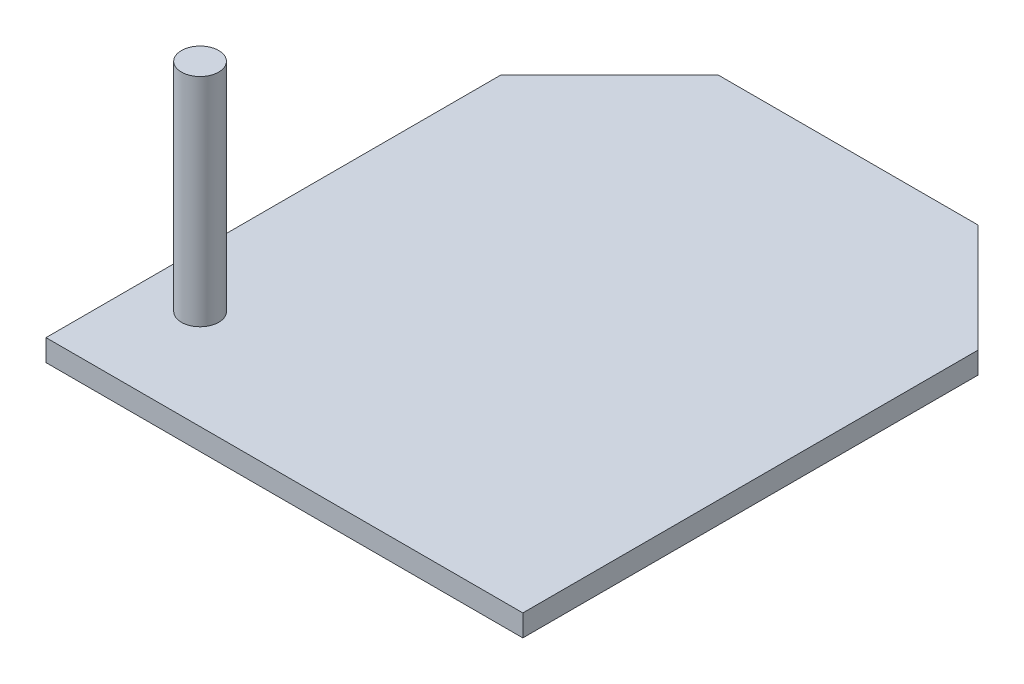
ISO-10303-21;
HEADER;
FILE_DESCRIPTION(('STEP AP214'),'2;1');
FILE_NAME('part.step','',(''),(''),'','','');
FILE_SCHEMA(('AUTOMOTIVE_DESIGN { 1 0 10303 214 1 1 1 1 }'));
ENDSEC;
DATA;
#1=APPLICATION_CONTEXT('core data for automotive mechanical design processes');
#2=APPLICATION_PROTOCOL_DEFINITION('international standard','automotive_design',2000,#1);
#3=PRODUCT_CONTEXT('',#1,'mechanical');
#4=PRODUCT('Part','Part','',(#3));
#5=PRODUCT_RELATED_PRODUCT_CATEGORY('part','',(#4));
#6=PRODUCT_DEFINITION_FORMATION('','',#4);
#7=PRODUCT_DEFINITION_CONTEXT('part definition',#1,'design');
#8=PRODUCT_DEFINITION('design','',#6,#7);
#9=PRODUCT_DEFINITION_SHAPE('','',#8);
#10=(LENGTH_UNIT() NAMED_UNIT(*) SI_UNIT(.MILLI.,.METRE.));
#11=(NAMED_UNIT(*) PLANE_ANGLE_UNIT() SI_UNIT($,.RADIAN.));
#12=(NAMED_UNIT(*) SI_UNIT($,.STERADIAN.) SOLID_ANGLE_UNIT());
#13=UNCERTAINTY_MEASURE_WITH_UNIT(LENGTH_MEASURE(1.E-05),#10,'distance_accuracy_value','');
#14=(GEOMETRIC_REPRESENTATION_CONTEXT(3) GLOBAL_UNCERTAINTY_ASSIGNED_CONTEXT((#13)) GLOBAL_UNIT_ASSIGNED_CONTEXT((#10,
#11,#12)) REPRESENTATION_CONTEXT('',''));
#15=CARTESIAN_POINT('',(0.,0.,0.));
#16=DIRECTION('',(0.,0.,1.));
#17=DIRECTION('',(1.,0.,0.));
#18=AXIS2_PLACEMENT_3D('',#15,#16,#17);
#19=CARTESIAN_POINT('',(-9.48923841059602,1.,-10.9870860927152));
#20=DIRECTION('',(0.,-1.,0.));
#21=DIRECTION('',(0.,0.,-1.));
#22=AXIS2_PLACEMENT_3D('',#19,#20,#21);
#23=PLANE('',#22);
#24=DIRECTION('',(-1.,0.,0.));
#25=VECTOR('',#24,1.);
#26=CARTESIAN_POINT('',(-9.48923841059602,1.,-10.9870860927152));
#27=LINE('',#26,#25);
#28=CARTESIAN_POINT('',(7.51076158940397,1.,-10.9870860927152));
#29=VERTEX_POINT('',#28);
#30=CARTESIAN_POINT('',(-4.489238410596,1.,-10.9870860927152));
#31=VERTEX_POINT('',#30);
#32=EDGE_CURVE('E115',#29,#31,#27,.T.);
#33=ORIENTED_EDGE('',*,*,#32,.T.);
#34=DIRECTION('',(0.707106781186549,0.,-0.707106781186546));
#35=VECTOR('',#34,1.);
#36=CARTESIAN_POINT('',(-9.48923841059602,1.,-5.98708609271523));
#37=LINE('',#36,#35);
#38=CARTESIAN_POINT('',(-9.48923841059602,1.,-5.98708609271523));
#39=VERTEX_POINT('',#38);
#40=EDGE_CURVE('E92',#31,#39,#37,.F.);
#41=ORIENTED_EDGE('',*,*,#40,.T.);
#42=DIRECTION('',(0.,0.,1.));
#43=VECTOR('',#42,1.);
#44=CARTESIAN_POINT('',(-9.48923841059602,1.,15.0129139072848));
#45=LINE('',#44,#43);
#46=CARTESIAN_POINT('',(-9.48923841059602,1.,15.0129139072848));
#47=VERTEX_POINT('',#46);
#48=EDGE_CURVE('E86',#39,#47,#45,.T.);
#49=ORIENTED_EDGE('',*,*,#48,.T.);
#50=DIRECTION('',(1.,0.,0.));
#51=VECTOR('',#50,1.);
#52=CARTESIAN_POINT('',(-9.48923841059602,1.,15.0129139072848));
#53=LINE('',#52,#51);
#54=CARTESIAN_POINT('',(12.510761589404,1.,15.0129139072848));
#55=VERTEX_POINT('',#54);
#56=EDGE_CURVE('E89',#47,#55,#53,.T.);
#57=ORIENTED_EDGE('',*,*,#56,.T.);
#58=DIRECTION('',(0.,0.,-1.));
#59=VECTOR('',#58,1.);
#60=CARTESIAN_POINT('',(12.510761589404,1.,15.0129139072848));
#61=LINE('',#60,#59);
#62=CARTESIAN_POINT('',(12.510761589404,1.,-5.9870860927152));
#63=VERTEX_POINT('',#62);
#64=EDGE_CURVE('E105',#55,#63,#61,.T.);
#65=ORIENTED_EDGE('',*,*,#64,.T.);
#66=DIRECTION('',(0.707106781186546,0.,0.707106781186549));
#67=VECTOR('',#66,1.);
#68=CARTESIAN_POINT('',(7.51076158940397,1.,-10.9870860927152));
#69=LINE('',#68,#67);
#70=EDGE_CURVE('E126',#63,#29,#69,.F.);
#71=ORIENTED_EDGE('',*,*,#70,.T.);
#72=EDGE_LOOP('',(#33,#41,#49,#57,#65,#71));
#73=FACE_BOUND('',#72,.T.);
#74=CARTESIAN_POINT('',(-6.97572857498585,1.,10.4177302678323));
#75=DIRECTION('',(0.,-1.,0.));
#76=DIRECTION('',(0.,0.,-1.));
#77=AXIS2_PLACEMENT_3D('',#74,#75,#76);
#78=CIRCLE('',#77,0.861123247014774);
#79=CARTESIAN_POINT('',(-6.97572857498585,1.,9.55660702081755));
#80=VERTEX_POINT('',#79);
#81=EDGE_CURVE('E11',#80,#80,#78,.F.);
#82=ORIENTED_EDGE('',*,*,#81,.F.);
#83=EDGE_LOOP('',(#82));
#84=FACE_BOUND('',#83,.T.);
#85=ADVANCED_FACE('F31',(#73,#84),#23,.F.);
#86=CARTESIAN_POINT('',(-9.48923841059602,1.,15.0129139072848));
#87=DIRECTION('',(1.,0.,0.));
#88=DIRECTION('',(0.,0.,-1.));
#89=AXIS2_PLACEMENT_3D('',#86,#87,#88);
#90=PLANE('',#89);
#91=ORIENTED_EDGE('',*,*,#48,.F.);
#92=DIRECTION('',(0.,-1.,0.));
#93=VECTOR('',#92,1.);
#94=CARTESIAN_POINT('',(-9.48923841059602,1.,-5.98708609271523));
#95=LINE('',#94,#93);
#96=CARTESIAN_POINT('',(-9.48923841059602,0.,-5.98708609271523));
#97=VERTEX_POINT('',#96);
#98=EDGE_CURVE('E111',#39,#97,#95,.T.);
#99=ORIENTED_EDGE('',*,*,#98,.T.);
#100=DIRECTION('',(0.,0.,1.));
#101=VECTOR('',#100,1.);
#102=CARTESIAN_POINT('',(-9.48923841059602,0.,15.0129139072848));
#103=LINE('',#102,#101);
#104=CARTESIAN_POINT('',(-9.48923841059602,0.,15.0129139072848));
#105=VERTEX_POINT('',#104);
#106=EDGE_CURVE('E109',#97,#105,#103,.T.);
#107=ORIENTED_EDGE('',*,*,#106,.T.);
#108=DIRECTION('',(0.,-1.,0.));
#109=VECTOR('',#108,1.);
#110=CARTESIAN_POINT('',(-9.48923841059602,1.,15.0129139072848));
#111=LINE('',#110,#109);
#112=EDGE_CURVE('E102',#47,#105,#111,.T.);
#113=ORIENTED_EDGE('',*,*,#112,.F.);
#114=EDGE_LOOP('',(#91,#99,#107,#113));
#115=FACE_BOUND('',#114,.T.);
#116=ADVANCED_FACE('F107',(#115),#90,.F.);
#117=CARTESIAN_POINT('',(-9.48923841059602,1.,15.0129139072848));
#118=DIRECTION('',(0.,0.,-1.));
#119=DIRECTION('',(-1.,0.,0.));
#120=AXIS2_PLACEMENT_3D('',#117,#118,#119);
#121=PLANE('',#120);
#122=DIRECTION('',(1.,0.,0.));
#123=VECTOR('',#122,1.);
#124=CARTESIAN_POINT('',(-9.48923841059602,0.,15.0129139072848));
#125=LINE('',#124,#123);
#126=CARTESIAN_POINT('',(12.510761589404,0.,15.0129139072848));
#127=VERTEX_POINT('',#126);
#128=EDGE_CURVE('E139',#105,#127,#125,.T.);
#129=ORIENTED_EDGE('',*,*,#128,.T.);
#130=DIRECTION('',(0.,-1.,0.));
#131=VECTOR('',#130,1.);
#132=CARTESIAN_POINT('',(12.510761589404,1.,15.0129139072848));
#133=LINE('',#132,#131);
#134=EDGE_CURVE('E104',#55,#127,#133,.T.);
#135=ORIENTED_EDGE('',*,*,#134,.F.);
#136=ORIENTED_EDGE('',*,*,#56,.F.);
#137=ORIENTED_EDGE('',*,*,#112,.T.);
#138=EDGE_LOOP('',(#129,#135,#136,#137));
#139=FACE_BOUND('',#138,.T.);
#140=ADVANCED_FACE('F101',(#139),#121,.F.);
#141=CARTESIAN_POINT('',(12.510761589404,1.,15.0129139072848));
#142=DIRECTION('',(-1.,0.,0.));
#143=DIRECTION('',(0.,0.,1.));
#144=AXIS2_PLACEMENT_3D('',#141,#142,#143);
#145=PLANE('',#144);
#146=DIRECTION('',(0.,0.,-1.));
#147=VECTOR('',#146,1.);
#148=CARTESIAN_POINT('',(12.510761589404,0.,15.0129139072848));
#149=LINE('',#148,#147);
#150=CARTESIAN_POINT('',(12.510761589404,0.,-5.9870860927152));
#151=VERTEX_POINT('',#150);
#152=EDGE_CURVE('E137',#127,#151,#149,.T.);
#153=ORIENTED_EDGE('',*,*,#152,.T.);
#154=DIRECTION('',(0.,1.,0.));
#155=VECTOR('',#154,1.);
#156=CARTESIAN_POINT('',(12.510761589404,1.,-5.98708609271521));
#157=LINE('',#156,#155);
#158=EDGE_CURVE('E39',#151,#63,#157,.T.);
#159=ORIENTED_EDGE('',*,*,#158,.T.);
#160=ORIENTED_EDGE('',*,*,#64,.F.);
#161=ORIENTED_EDGE('',*,*,#134,.T.);
#162=EDGE_LOOP('',(#153,#159,#160,#161));
#163=FACE_BOUND('',#162,.T.);
#164=ADVANCED_FACE('F138',(#163),#145,.F.);
#165=CARTESIAN_POINT('',(-9.48923841059602,1.,-10.9870860927152));
#166=DIRECTION('',(0.,0.,1.));
#167=DIRECTION('',(1.,0.,0.));
#168=AXIS2_PLACEMENT_3D('',#165,#166,#167);
#169=PLANE('',#168);
#170=DIRECTION('',(-1.,0.,0.));
#171=VECTOR('',#170,1.);
#172=CARTESIAN_POINT('',(-9.48923841059602,0.,-10.9870860927152));
#173=LINE('',#172,#171);
#174=CARTESIAN_POINT('',(7.51076158940398,0.,-10.9870860927152));
#175=VERTEX_POINT('',#174);
#176=CARTESIAN_POINT('',(-4.489238410596,0.,-10.9870860927152));
#177=VERTEX_POINT('',#176);
#178=EDGE_CURVE('E97',#175,#177,#173,.T.);
#179=ORIENTED_EDGE('',*,*,#178,.T.);
#180=DIRECTION('',(0.,1.,0.));
#181=VECTOR('',#180,1.);
#182=CARTESIAN_POINT('',(-4.489238410596,1.,-10.9870860927152));
#183=LINE('',#182,#181);
#184=EDGE_CURVE('E53',#177,#31,#183,.T.);
#185=ORIENTED_EDGE('',*,*,#184,.T.);
#186=ORIENTED_EDGE('',*,*,#32,.F.);
#187=DIRECTION('',(0.,-1.,0.));
#188=VECTOR('',#187,1.);
#189=CARTESIAN_POINT('',(7.51076158940397,1.,-10.9870860927152));
#190=LINE('',#189,#188);
#191=EDGE_CURVE('E122',#29,#175,#190,.T.);
#192=ORIENTED_EDGE('',*,*,#191,.T.);
#193=EDGE_LOOP('',(#179,#185,#186,#192));
#194=FACE_BOUND('',#193,.T.);
#195=ADVANCED_FACE('F131',(#194),#169,.F.);
#196=CARTESIAN_POINT('',(-9.48923841059602,0.,-10.9870860927152));
#197=DIRECTION('',(0.,-1.,0.));
#198=DIRECTION('',(0.,0.,-1.));
#199=AXIS2_PLACEMENT_3D('',#196,#197,#198);
#200=PLANE('',#199);
#201=ORIENTED_EDGE('',*,*,#106,.F.);
#202=DIRECTION('',(-0.707106781186549,0.,0.707106781186546));
#203=VECTOR('',#202,1.);
#204=CARTESIAN_POINT('',(-6.98923841059602,0.,-8.48708609271523));
#205=LINE('',#204,#203);
#206=EDGE_CURVE('E120',#97,#177,#205,.F.);
#207=ORIENTED_EDGE('',*,*,#206,.T.);
#208=ORIENTED_EDGE('',*,*,#178,.F.);
#209=DIRECTION('',(-0.707106781186546,0.,-0.707106781186549));
#210=VECTOR('',#209,1.);
#211=CARTESIAN_POINT('',(-0.989238410595995,0.,-19.4870860927152));
#212=LINE('',#211,#210);
#213=EDGE_CURVE('E113',#175,#151,#212,.F.);
#214=ORIENTED_EDGE('',*,*,#213,.T.);
#215=ORIENTED_EDGE('',*,*,#152,.F.);
#216=ORIENTED_EDGE('',*,*,#128,.F.);
#217=EDGE_LOOP('',(#201,#207,#208,#214,#215,#216));
#218=FACE_BOUND('',#217,.T.);
#219=ADVANCED_FACE('F136',(#218),#200,.T.);
#220=CARTESIAN_POINT('',(-9.48923841059602,1.,-5.98708609271523));
#221=DIRECTION('',(0.707106781186546,0.,0.707106781186549));
#222=DIRECTION('',(0.707106781186549,0.,-0.707106781186546));
#223=AXIS2_PLACEMENT_3D('',#220,#221,#222);
#224=PLANE('',#223);
#225=ORIENTED_EDGE('',*,*,#40,.F.);
#226=ORIENTED_EDGE('',*,*,#184,.F.);
#227=ORIENTED_EDGE('',*,*,#206,.F.);
#228=ORIENTED_EDGE('',*,*,#98,.F.);
#229=EDGE_LOOP('',(#225,#226,#227,#228));
#230=FACE_BOUND('',#229,.T.);
#231=ADVANCED_FACE('F166',(#230),#224,.F.);
#232=CARTESIAN_POINT('',(7.51076158940397,1.,-10.9870860927152));
#233=DIRECTION('',(-0.707106781186549,0.,0.707106781186546));
#234=DIRECTION('',(0.707106781186546,0.,0.707106781186549));
#235=AXIS2_PLACEMENT_3D('',#232,#233,#234);
#236=PLANE('',#235);
#237=ORIENTED_EDGE('',*,*,#70,.F.);
#238=ORIENTED_EDGE('',*,*,#158,.F.);
#239=ORIENTED_EDGE('',*,*,#213,.F.);
#240=ORIENTED_EDGE('',*,*,#191,.F.);
#241=EDGE_LOOP('',(#237,#238,#239,#240));
#242=FACE_BOUND('',#241,.T.);
#243=ADVANCED_FACE('F33',(#242),#236,.F.);
#244=CARTESIAN_POINT('',(-6.97572857498585,11.,10.4177302678323));
#245=DIRECTION('',(0.,-1.,0.));
#246=DIRECTION('',(0.,0.,-1.));
#247=AXIS2_PLACEMENT_3D('',#244,#245,#246);
#248=CYLINDRICAL_SURFACE('',#247,0.861123247014774);
#249=CARTESIAN_POINT('',(-6.97572857498585,11.,10.4177302678323));
#250=DIRECTION('',(0.,1.,0.));
#251=DIRECTION('',(0.,0.,1.));
#252=AXIS2_PLACEMENT_3D('',#249,#250,#251);
#253=CIRCLE('',#252,0.861123247014774);
#254=CARTESIAN_POINT('',(-6.97572857498585,11.,11.2788535148471));
#255=VERTEX_POINT('',#254);
#256=EDGE_CURVE('E143',#255,#255,#253,.T.);
#257=ORIENTED_EDGE('',*,*,#256,.F.);
#258=EDGE_LOOP('',(#257));
#259=FACE_BOUND('',#258,.T.);
#260=ORIENTED_EDGE('',*,*,#81,.T.);
#261=EDGE_LOOP('',(#260));
#262=FACE_BOUND('',#261,.T.);
#263=ADVANCED_FACE('F151',(#259,#262),#248,.T.);
#264=CARTESIAN_POINT('',(-6.97572857498585,11.,10.4177302678323));
#265=DIRECTION('',(0.,1.,0.));
#266=DIRECTION('',(0.,0.,1.));
#267=AXIS2_PLACEMENT_3D('',#264,#265,#266);
#268=PLANE('',#267);
#269=ORIENTED_EDGE('',*,*,#256,.T.);
#270=EDGE_LOOP('',(#269));
#271=FACE_BOUND('',#270,.T.);
#272=ADVANCED_FACE('F149',(#271),#268,.T.);
#273=CLOSED_SHELL('',(#85,#116,#140,#164,#195,#219,#231,#243,#263,#272));
#274=MANIFOLD_SOLID_BREP('B2',#273);
#275=ADVANCED_BREP_SHAPE_REPRESENTATION('',(#18,#274),#14);
#276=SHAPE_DEFINITION_REPRESENTATION(#9,#275);
ENDSEC;
END-ISO-10303-21;
